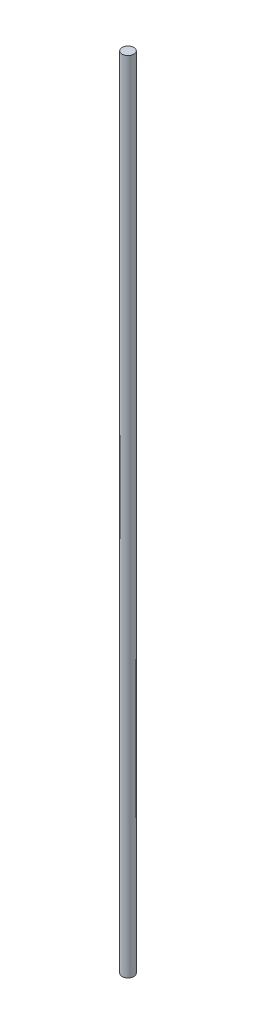
ISO-10303-21;
HEADER;
FILE_DESCRIPTION(('STEP AP214'),'2;1');
FILE_NAME('part.step','',(''),(''),'','','');
FILE_SCHEMA(('AUTOMOTIVE_DESIGN { 1 0 10303 214 1 1 1 1 }'));
ENDSEC;
DATA;
#1=APPLICATION_CONTEXT('core data for automotive mechanical design processes');
#2=APPLICATION_PROTOCOL_DEFINITION('international standard','automotive_design',2000,#1);
#3=PRODUCT_CONTEXT('',#1,'mechanical');
#4=PRODUCT('Part','Part','',(#3));
#5=PRODUCT_RELATED_PRODUCT_CATEGORY('part','',(#4));
#6=PRODUCT_DEFINITION_FORMATION('','',#4);
#7=PRODUCT_DEFINITION_CONTEXT('part definition',#1,'design');
#8=PRODUCT_DEFINITION('design','',#6,#7);
#9=PRODUCT_DEFINITION_SHAPE('','',#8);
#10=(LENGTH_UNIT() NAMED_UNIT(*) SI_UNIT(.MILLI.,.METRE.));
#11=(NAMED_UNIT(*) PLANE_ANGLE_UNIT() SI_UNIT($,.RADIAN.));
#12=(NAMED_UNIT(*) SI_UNIT($,.STERADIAN.) SOLID_ANGLE_UNIT());
#13=UNCERTAINTY_MEASURE_WITH_UNIT(LENGTH_MEASURE(1.E-05),#10,'distance_accuracy_value','');
#14=(GEOMETRIC_REPRESENTATION_CONTEXT(3) GLOBAL_UNCERTAINTY_ASSIGNED_CONTEXT((#13)) GLOBAL_UNIT_ASSIGNED_CONTEXT((#10,
#11,#12)) REPRESENTATION_CONTEXT('',''));
#15=CARTESIAN_POINT('',(0.,0.,0.));
#16=DIRECTION('',(0.,0.,1.));
#17=DIRECTION('',(1.,0.,0.));
#18=AXIS2_PLACEMENT_3D('',#15,#16,#17);
#19=CARTESIAN_POINT('',(0.,431.8,0.));
#20=DIRECTION('',(0.,-1.,0.));
#21=DIRECTION('',(0.,0.,-1.));
#22=AXIS2_PLACEMENT_3D('',#19,#20,#21);
#23=CYLINDRICAL_SURFACE('',#22,6.35);
#24=CARTESIAN_POINT('',(0.,431.8,0.));
#25=DIRECTION('',(0.,1.,0.));
#26=DIRECTION('',(0.,0.,1.));
#27=AXIS2_PLACEMENT_3D('',#24,#25,#26);
#28=CIRCLE('',#27,6.35);
#29=CARTESIAN_POINT('',(0.,431.8,6.35));
#30=VERTEX_POINT('',#29);
#31=EDGE_CURVE('E10',#30,#30,#28,.T.);
#32=ORIENTED_EDGE('',*,*,#31,.F.);
#33=EDGE_LOOP('',(#32));
#34=FACE_BOUND('',#33,.T.);
#35=CARTESIAN_POINT('',(0.,-431.8,0.));
#36=DIRECTION('',(0.,1.,0.));
#37=DIRECTION('',(0.,0.,1.));
#38=AXIS2_PLACEMENT_3D('',#35,#36,#37);
#39=CIRCLE('',#38,6.35);
#40=CARTESIAN_POINT('',(0.,-431.8,6.35));
#41=VERTEX_POINT('',#40);
#42=EDGE_CURVE('E18',#41,#41,#39,.T.);
#43=ORIENTED_EDGE('',*,*,#42,.T.);
#44=EDGE_LOOP('',(#43));
#45=FACE_BOUND('',#44,.T.);
#46=ADVANCED_FACE('F15',(#34,#45),#23,.T.);
#47=CARTESIAN_POINT('',(0.,431.8,0.));
#48=DIRECTION('',(0.,1.,0.));
#49=DIRECTION('',(0.,0.,1.));
#50=AXIS2_PLACEMENT_3D('',#47,#48,#49);
#51=PLANE('',#50);
#52=ORIENTED_EDGE('',*,*,#31,.T.);
#53=EDGE_LOOP('',(#52));
#54=FACE_BOUND('',#53,.T.);
#55=ADVANCED_FACE('F30',(#54),#51,.T.);
#56=CARTESIAN_POINT('',(0.,-431.8,0.));
#57=DIRECTION('',(0.,1.,0.));
#58=DIRECTION('',(0.,0.,1.));
#59=AXIS2_PLACEMENT_3D('',#56,#57,#58);
#60=PLANE('',#59);
#61=ORIENTED_EDGE('',*,*,#42,.F.);
#62=EDGE_LOOP('',(#61));
#63=FACE_BOUND('',#62,.T.);
#64=ADVANCED_FACE('F28',(#63),#60,.F.);
#65=CLOSED_SHELL('',(#46,#55,#64));
#66=MANIFOLD_SOLID_BREP('B1',#65);
#67=ADVANCED_BREP_SHAPE_REPRESENTATION('',(#18,#66),#14);
#68=SHAPE_DEFINITION_REPRESENTATION(#9,#67);
ENDSEC;
END-ISO-10303-21;
